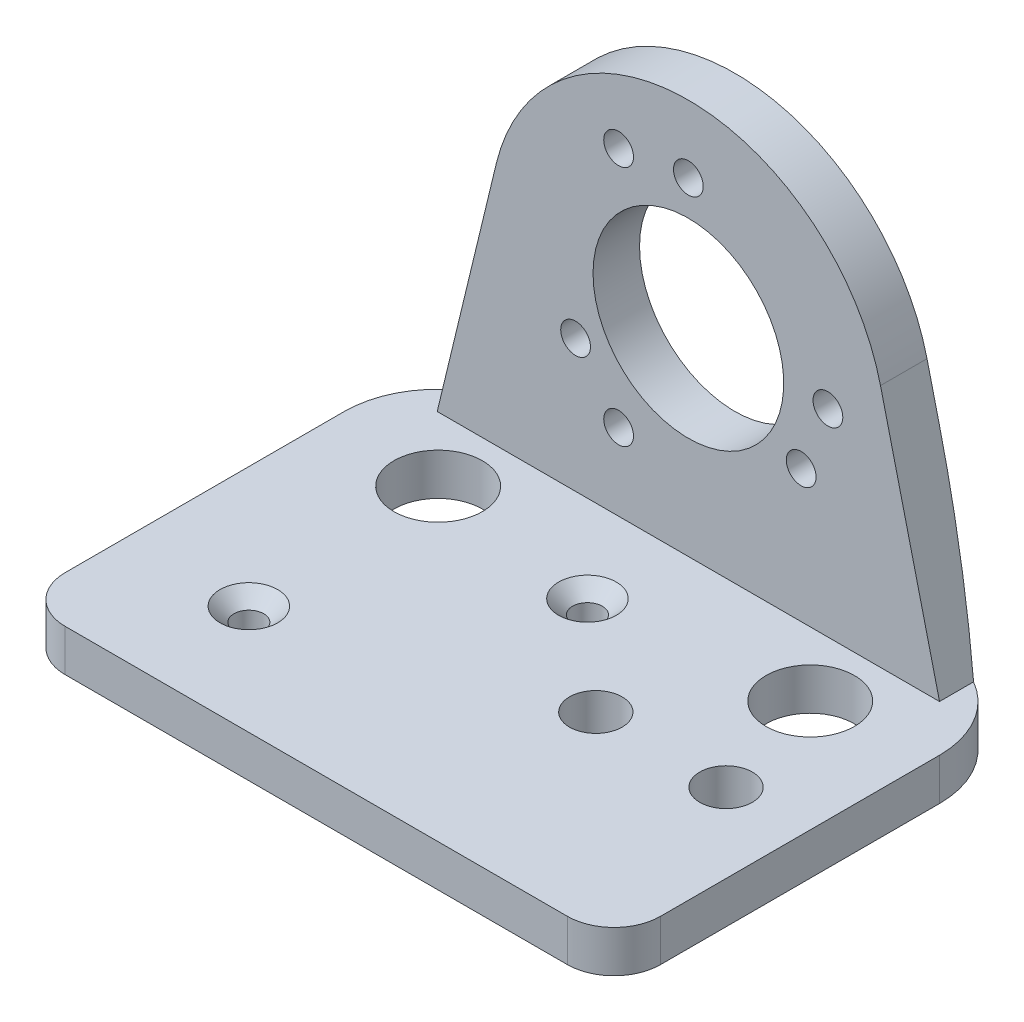
ISO-10303-21;
HEADER;
FILE_DESCRIPTION(('STEP AP214'),'2;1');
FILE_NAME('part.step','',(''),(''),'','','');
FILE_SCHEMA(('AUTOMOTIVE_DESIGN { 1 0 10303 214 1 1 1 1 }'));
ENDSEC;
DATA;
#1=APPLICATION_CONTEXT('core data for automotive mechanical design processes');
#2=APPLICATION_PROTOCOL_DEFINITION('international standard','automotive_design',2000,#1);
#3=PRODUCT_CONTEXT('',#1,'mechanical');
#4=PRODUCT('Part','Part','',(#3));
#5=PRODUCT_RELATED_PRODUCT_CATEGORY('part','',(#4));
#6=PRODUCT_DEFINITION_FORMATION('','',#4);
#7=PRODUCT_DEFINITION_CONTEXT('part definition',#1,'design');
#8=PRODUCT_DEFINITION('design','',#6,#7);
#9=PRODUCT_DEFINITION_SHAPE('','',#8);
#10=(LENGTH_UNIT() NAMED_UNIT(*) SI_UNIT(.MILLI.,.METRE.));
#11=(NAMED_UNIT(*) PLANE_ANGLE_UNIT() SI_UNIT($,.RADIAN.));
#12=(NAMED_UNIT(*) SI_UNIT($,.STERADIAN.) SOLID_ANGLE_UNIT());
#13=UNCERTAINTY_MEASURE_WITH_UNIT(LENGTH_MEASURE(1.E-05),#10,'distance_accuracy_value','');
#14=(GEOMETRIC_REPRESENTATION_CONTEXT(3) GLOBAL_UNCERTAINTY_ASSIGNED_CONTEXT((#13)) GLOBAL_UNIT_ASSIGNED_CONTEXT((#10,
#11,#12)) REPRESENTATION_CONTEXT('',''));
#15=CARTESIAN_POINT('',(0.,0.,0.));
#16=DIRECTION('',(0.,0.,1.));
#17=DIRECTION('',(1.,0.,0.));
#18=AXIS2_PLACEMENT_3D('',#15,#16,#17);
#19=CARTESIAN_POINT('',(-32.,-4.5,22.5));
#20=DIRECTION('',(-1.,0.,0.));
#21=DIRECTION('',(0.,0.,1.));
#22=AXIS2_PLACEMENT_3D('',#19,#20,#21);
#23=PLANE('',#22);
#24=DIRECTION('',(0.,0.,1.));
#25=VECTOR('',#24,1.);
#26=CARTESIAN_POINT('',(-32.,0.,22.5));
#27=LINE('',#26,#25);
#28=CARTESIAN_POINT('',(-32.,0.,-12.5));
#29=VERTEX_POINT('',#28);
#30=CARTESIAN_POINT('',(-32.,0.,17.5));
#31=VERTEX_POINT('',#30);
#32=EDGE_CURVE('E227',#29,#31,#27,.T.);
#33=ORIENTED_EDGE('',*,*,#32,.F.);
#34=DIRECTION('',(0.,1.,0.));
#35=VECTOR('',#34,1.);
#36=CARTESIAN_POINT('',(-32.,-4.5,-12.5));
#37=LINE('',#36,#35);
#38=CARTESIAN_POINT('',(-32.,-4.5,-12.5));
#39=VERTEX_POINT('',#38);
#40=EDGE_CURVE('E11',#29,#39,#37,.F.);
#41=ORIENTED_EDGE('',*,*,#40,.T.);
#42=DIRECTION('',(0.,0.,1.));
#43=VECTOR('',#42,1.);
#44=CARTESIAN_POINT('',(-32.,-4.5,22.5));
#45=LINE('',#44,#43);
#46=CARTESIAN_POINT('',(-32.,-4.5,17.5));
#47=VERTEX_POINT('',#46);
#48=EDGE_CURVE('E231',#39,#47,#45,.T.);
#49=ORIENTED_EDGE('',*,*,#48,.T.);
#50=DIRECTION('',(0.,1.,0.));
#51=VECTOR('',#50,1.);
#52=CARTESIAN_POINT('',(-32.,-4.5,17.5));
#53=LINE('',#52,#51);
#54=EDGE_CURVE('E297',#47,#31,#53,.T.);
#55=ORIENTED_EDGE('',*,*,#54,.T.);
#56=EDGE_LOOP('',(#33,#41,#49,#55));
#57=FACE_BOUND('',#56,.T.);
#58=ADVANCED_FACE('F47',(#57),#23,.T.);
#59=CARTESIAN_POINT('',(-32.,-4.5,-22.5));
#60=DIRECTION('',(0.,0.,-1.));
#61=DIRECTION('',(-1.,0.,0.));
#62=AXIS2_PLACEMENT_3D('',#59,#60,#61);
#63=PLANE('',#62);
#64=DIRECTION('',(0.235004499973529,-0.971994282386574,0.));
#65=VECTOR('',#64,1.);
#66=CARTESIAN_POINT('',(24.7695038509315,9.22548080578893,-22.5));
#67=LINE('',#66,#65);
#68=CARTESIAN_POINT('',(20.6548785007147,26.2438456244375,-22.5));
#69=VERTEX_POINT('',#68);
#70=CARTESIAN_POINT('',(22.,20.6803334084253,-22.5));
#71=VERTEX_POINT('',#70);
#72=EDGE_CURVE('E165',#69,#71,#67,.T.);
#73=ORIENTED_EDGE('',*,*,#72,.T.);
#74=DIRECTION('',(0.,1.,0.));
#75=VECTOR('',#74,1.);
#76=CARTESIAN_POINT('',(22.,-4.5,-22.5));
#77=LINE('',#76,#75);
#78=CARTESIAN_POINT('',(22.,-4.5,-22.5));
#79=VERTEX_POINT('',#78);
#80=EDGE_CURVE('E318',#71,#79,#77,.F.);
#81=ORIENTED_EDGE('',*,*,#80,.T.);
#82=DIRECTION('',(-1.,0.,0.));
#83=VECTOR('',#82,1.);
#84=CARTESIAN_POINT('',(-32.,-4.5,-22.5));
#85=LINE('',#84,#83);
#86=CARTESIAN_POINT('',(-22.,-4.5,-22.5));
#87=VERTEX_POINT('',#86);
#88=EDGE_CURVE('E243',#79,#87,#85,.T.);
#89=ORIENTED_EDGE('',*,*,#88,.T.);
#90=DIRECTION('',(0.,1.,0.));
#91=VECTOR('',#90,1.);
#92=CARTESIAN_POINT('',(-22.,-4.5,-22.5));
#93=LINE('',#92,#91);
#94=CARTESIAN_POINT('',(-22.,20.6803334084253,-22.5));
#95=VERTEX_POINT('',#94);
#96=EDGE_CURVE('E314',#87,#95,#93,.T.);
#97=ORIENTED_EDGE('',*,*,#96,.T.);
#98=DIRECTION('',(0.23500449997353,0.971994282386574,0.));
#99=VECTOR('',#98,1.);
#100=CARTESIAN_POINT('',(-28.3040392114313,-5.39359313401179,-22.5));
#101=LINE('',#100,#99);
#102=CARTESIAN_POINT('',(-20.6548785007147,26.2438456244375,-22.5));
#103=VERTEX_POINT('',#102);
#104=EDGE_CURVE('E176',#95,#103,#101,.T.);
#105=ORIENTED_EDGE('',*,*,#104,.T.);
#106=CARTESIAN_POINT('',(0.,21.25,-22.5));
#107=DIRECTION('',(0.,0.,-1.));
#108=DIRECTION('',(-1.,0.,0.));
#109=AXIS2_PLACEMENT_3D('',#106,#107,#108);
#110=CIRCLE('',#109,21.25);
#111=EDGE_CURVE('E143',#103,#69,#110,.T.);
#112=ORIENTED_EDGE('',*,*,#111,.T.);
#113=EDGE_LOOP('',(#73,#81,#89,#97,#105,#112));
#114=FACE_BOUND('',#113,.T.);
#115=CARTESIAN_POINT('',(0.,21.25,-22.5));
#116=DIRECTION('',(0.,0.,-1.));
#117=DIRECTION('',(-1.,0.,0.));
#118=AXIS2_PLACEMENT_3D('',#115,#116,#117);
#119=CIRCLE('',#118,10.25);
#120=CARTESIAN_POINT('',(-10.25,21.25,-22.5));
#121=VERTEX_POINT('',#120);
#122=EDGE_CURVE('E171',#121,#121,#119,.T.);
#123=ORIENTED_EDGE('',*,*,#122,.F.);
#124=EDGE_LOOP('',(#123));
#125=FACE_BOUND('',#124,.T.);
#126=CARTESIAN_POINT('',(0.,35.2500000000002,-22.5));
#127=DIRECTION('',(0.,0.,-1.));
#128=DIRECTION('',(-1.,0.,0.));
#129=AXIS2_PLACEMENT_3D('',#126,#127,#128);
#130=CIRCLE('',#129,1.59999999999994);
#131=CARTESIAN_POINT('',(-1.59999999999994,35.2500000000002,-22.5));
#132=VERTEX_POINT('',#131);
#133=EDGE_CURVE('E693',#132,#132,#130,.T.);
#134=ORIENTED_EDGE('',*,*,#133,.F.);
#135=EDGE_LOOP('',(#134));
#136=FACE_BOUND('',#135,.T.);
#137=CARTESIAN_POINT('',(-7.49999999999992,34.2403810567666,-22.5));
#138=DIRECTION('',(0.,0.,-1.));
#139=DIRECTION('',(-1.,0.,0.));
#140=AXIS2_PLACEMENT_3D('',#137,#138,#139);
#141=CIRCLE('',#140,1.6);
#142=CARTESIAN_POINT('',(-9.09999999999992,34.2403810567666,-22.5));
#143=VERTEX_POINT('',#142);
#144=EDGE_CURVE('E699',#143,#143,#141,.T.);
#145=ORIENTED_EDGE('',*,*,#144,.F.);
#146=EDGE_LOOP('',(#145));
#147=FACE_BOUND('',#146,.T.);
#148=CARTESIAN_POINT('',(12.1243556529821,14.25,-22.5));
#149=DIRECTION('',(0.,0.,-1.));
#150=DIRECTION('',(-1.,0.,0.));
#151=AXIS2_PLACEMENT_3D('',#148,#149,#150);
#152=CIRCLE('',#151,1.6);
#153=CARTESIAN_POINT('',(10.5243556529821,14.25,-22.5));
#154=VERTEX_POINT('',#153);
#155=EDGE_CURVE('E705',#154,#154,#152,.T.);
#156=ORIENTED_EDGE('',*,*,#155,.F.);
#157=EDGE_LOOP('',(#156));
#158=FACE_BOUND('',#157,.T.);
#159=CARTESIAN_POINT('',(15.,21.2500000000001,-22.5));
#160=DIRECTION('',(0.,0.,-1.));
#161=DIRECTION('',(-1.,0.,0.));
#162=AXIS2_PLACEMENT_3D('',#159,#160,#161);
#163=CIRCLE('',#162,1.59999999999994);
#164=CARTESIAN_POINT('',(13.4000000000001,21.2500000000001,-22.5));
#165=VERTEX_POINT('',#164);
#166=EDGE_CURVE('E711',#165,#165,#163,.T.);
#167=ORIENTED_EDGE('',*,*,#166,.F.);
#168=EDGE_LOOP('',(#167));
#169=FACE_BOUND('',#168,.T.);
#170=CARTESIAN_POINT('',(-12.1243556529821,14.2500000000001,-22.5));
#171=DIRECTION('',(0.,0.,-1.));
#172=DIRECTION('',(-1.,0.,0.));
#173=AXIS2_PLACEMENT_3D('',#170,#171,#172);
#174=CIRCLE('',#173,1.59999999999995);
#175=CARTESIAN_POINT('',(-13.7243556529821,14.2500000000001,-22.5));
#176=VERTEX_POINT('',#175);
#177=EDGE_CURVE('E717',#176,#176,#174,.T.);
#178=ORIENTED_EDGE('',*,*,#177,.F.);
#179=EDGE_LOOP('',(#178));
#180=FACE_BOUND('',#179,.T.);
#181=CARTESIAN_POINT('',(-7.50000000000006,8.25961894323362,-22.5));
#182=DIRECTION('',(0.,0.,-1.));
#183=DIRECTION('',(-1.,0.,0.));
#184=AXIS2_PLACEMENT_3D('',#181,#182,#183);
#185=CIRCLE('',#184,1.59999999999995);
#186=CARTESIAN_POINT('',(-9.10000000000001,8.25961894323362,-22.5));
#187=VERTEX_POINT('',#186);
#188=EDGE_CURVE('E723',#187,#187,#185,.T.);
#189=ORIENTED_EDGE('',*,*,#188,.F.);
#190=EDGE_LOOP('',(#189));
#191=FACE_BOUND('',#190,.T.);
#192=ADVANCED_FACE('F333',(#114,#125,#136,#147,#158,#169,#180,#191),#63,.T.);
#193=CARTESIAN_POINT('',(32.,-4.5,22.5));
#194=DIRECTION('',(1.,0.,0.));
#195=DIRECTION('',(0.,0.,-1.));
#196=AXIS2_PLACEMENT_3D('',#193,#194,#195);
#197=PLANE('',#196);
#198=DIRECTION('',(0.,0.,-1.));
#199=VECTOR('',#198,1.);
#200=CARTESIAN_POINT('',(32.,-4.5,22.5));
#201=LINE('',#200,#199);
#202=CARTESIAN_POINT('',(32.,-4.5,17.5));
#203=VERTEX_POINT('',#202);
#204=CARTESIAN_POINT('',(32.,-4.5,-12.5));
#205=VERTEX_POINT('',#204);
#206=EDGE_CURVE('E239',#203,#205,#201,.T.);
#207=ORIENTED_EDGE('',*,*,#206,.T.);
#208=DIRECTION('',(0.,1.,0.));
#209=VECTOR('',#208,1.);
#210=CARTESIAN_POINT('',(32.,-4.5,-12.5));
#211=LINE('',#210,#209);
#212=CARTESIAN_POINT('',(32.,0.,-12.5));
#213=VERTEX_POINT('',#212);
#214=EDGE_CURVE('E301',#205,#213,#211,.T.);
#215=ORIENTED_EDGE('',*,*,#214,.T.);
#216=DIRECTION('',(0.,0.,-1.));
#217=VECTOR('',#216,1.);
#218=CARTESIAN_POINT('',(32.,0.,22.5));
#219=LINE('',#218,#217);
#220=CARTESIAN_POINT('',(32.,0.,17.5));
#221=VERTEX_POINT('',#220);
#222=EDGE_CURVE('E235',#221,#213,#219,.T.);
#223=ORIENTED_EDGE('',*,*,#222,.F.);
#224=DIRECTION('',(0.,1.,0.));
#225=VECTOR('',#224,1.);
#226=CARTESIAN_POINT('',(32.,-4.5,17.5));
#227=LINE('',#226,#225);
#228=EDGE_CURVE('E287',#221,#203,#227,.F.);
#229=ORIENTED_EDGE('',*,*,#228,.T.);
#230=EDGE_LOOP('',(#207,#215,#223,#229));
#231=FACE_BOUND('',#230,.T.);
#232=ADVANCED_FACE('F346',(#231),#197,.T.);
#233=CARTESIAN_POINT('',(-32.,-4.5,22.5));
#234=DIRECTION('',(0.,0.,1.));
#235=DIRECTION('',(1.,0.,0.));
#236=AXIS2_PLACEMENT_3D('',#233,#234,#235);
#237=PLANE('',#236);
#238=DIRECTION('',(1.,0.,0.));
#239=VECTOR('',#238,1.);
#240=CARTESIAN_POINT('',(-32.,-4.5,22.5));
#241=LINE('',#240,#239);
#242=CARTESIAN_POINT('',(-27.,-4.5,22.5));
#243=VERTEX_POINT('',#242);
#244=CARTESIAN_POINT('',(27.,-4.5,22.5));
#245=VERTEX_POINT('',#244);
#246=EDGE_CURVE('E234',#243,#245,#241,.T.);
#247=ORIENTED_EDGE('',*,*,#246,.T.);
#248=DIRECTION('',(0.,1.,0.));
#249=VECTOR('',#248,1.);
#250=CARTESIAN_POINT('',(27.,-4.5,22.5));
#251=LINE('',#250,#249);
#252=CARTESIAN_POINT('',(27.,0.,22.5));
#253=VERTEX_POINT('',#252);
#254=EDGE_CURVE('E277',#245,#253,#251,.T.);
#255=ORIENTED_EDGE('',*,*,#254,.T.);
#256=DIRECTION('',(1.,0.,0.));
#257=VECTOR('',#256,1.);
#258=CARTESIAN_POINT('',(-32.,0.,22.5));
#259=LINE('',#258,#257);
#260=CARTESIAN_POINT('',(-27.,0.,22.5));
#261=VERTEX_POINT('',#260);
#262=EDGE_CURVE('E249',#261,#253,#259,.T.);
#263=ORIENTED_EDGE('',*,*,#262,.F.);
#264=DIRECTION('',(0.,1.,0.));
#265=VECTOR('',#264,1.);
#266=CARTESIAN_POINT('',(-27.,-4.5,22.5));
#267=LINE('',#266,#265);
#268=EDGE_CURVE('E274',#261,#243,#267,.F.);
#269=ORIENTED_EDGE('',*,*,#268,.T.);
#270=EDGE_LOOP('',(#247,#255,#263,#269));
#271=FACE_BOUND('',#270,.T.);
#272=ADVANCED_FACE('F354',(#271),#237,.T.);
#273=CARTESIAN_POINT('',(0.,-4.5,0.));
#274=DIRECTION('',(0.,-1.,0.));
#275=DIRECTION('',(0.,0.,-1.));
#276=AXIS2_PLACEMENT_3D('',#273,#274,#275);
#277=PLANE('',#276);
#278=ORIENTED_EDGE('',*,*,#88,.F.);
#279=CARTESIAN_POINT('',(22.,-4.5,-12.5));
#280=DIRECTION('',(0.,-1.,0.));
#281=DIRECTION('',(0.,0.,-1.));
#282=AXIS2_PLACEMENT_3D('',#279,#280,#281);
#283=CIRCLE('',#282,10.);
#284=EDGE_CURVE('E323',#79,#205,#283,.T.);
#285=ORIENTED_EDGE('',*,*,#284,.T.);
#286=ORIENTED_EDGE('',*,*,#206,.F.);
#287=CARTESIAN_POINT('',(27.,-4.5,17.5));
#288=DIRECTION('',(0.,-1.,0.));
#289=DIRECTION('',(0.,0.,-1.));
#290=AXIS2_PLACEMENT_3D('',#287,#288,#289);
#291=CIRCLE('',#290,5.);
#292=EDGE_CURVE('E294',#203,#245,#291,.T.);
#293=ORIENTED_EDGE('',*,*,#292,.T.);
#294=ORIENTED_EDGE('',*,*,#246,.F.);
#295=CARTESIAN_POINT('',(-27.,-4.5,17.5));
#296=DIRECTION('',(0.,-1.,0.));
#297=DIRECTION('',(0.,0.,-1.));
#298=AXIS2_PLACEMENT_3D('',#295,#296,#297);
#299=CIRCLE('',#298,5.);
#300=EDGE_CURVE('E290',#243,#47,#299,.T.);
#301=ORIENTED_EDGE('',*,*,#300,.T.);
#302=ORIENTED_EDGE('',*,*,#48,.F.);
#303=CARTESIAN_POINT('',(-22.,-4.5,-12.5));
#304=DIRECTION('',(0.,-1.,0.));
#305=DIRECTION('',(0.,0.,-1.));
#306=AXIS2_PLACEMENT_3D('',#303,#304,#305);
#307=CIRCLE('',#306,10.);
#308=EDGE_CURVE('E68',#39,#87,#307,.T.);
#309=ORIENTED_EDGE('',*,*,#308,.T.);
#310=EDGE_LOOP('',(#278,#285,#286,#293,#294,#301,#302,#309));
#311=FACE_BOUND('',#310,.T.);
#312=CARTESIAN_POINT('',(-20.,-4.5,-10.6));
#313=DIRECTION('',(0.,1.,0.));
#314=DIRECTION('',(0.,0.,1.));
#315=AXIS2_PLACEMENT_3D('',#312,#313,#314);
#316=CIRCLE('',#315,4.75);
#317=CARTESIAN_POINT('',(-20.,-4.5,-5.85));
#318=VERTEX_POINT('',#317);
#319=EDGE_CURVE('E191',#318,#318,#316,.T.);
#320=ORIENTED_EDGE('',*,*,#319,.T.);
#321=EDGE_LOOP('',(#320));
#322=FACE_BOUND('',#321,.T.);
#323=CARTESIAN_POINT('',(9.5,-4.5,1.95));
#324=DIRECTION('',(0.,1.,0.));
#325=DIRECTION('',(0.,0.,1.));
#326=AXIS2_PLACEMENT_3D('',#323,#324,#325);
#327=CIRCLE('',#326,2.825);
#328=CARTESIAN_POINT('',(9.5,-4.5,4.775));
#329=VERTEX_POINT('',#328);
#330=EDGE_CURVE('E199',#329,#329,#327,.T.);
#331=ORIENTED_EDGE('',*,*,#330,.T.);
#332=EDGE_LOOP('',(#331));
#333=FACE_BOUND('',#332,.T.);
#334=CARTESIAN_POINT('',(20.,-4.5,-10.6));
#335=DIRECTION('',(0.,1.,0.));
#336=DIRECTION('',(0.,0.,1.));
#337=AXIS2_PLACEMENT_3D('',#334,#335,#336);
#338=CIRCLE('',#337,4.75);
#339=CARTESIAN_POINT('',(20.,-4.5,-5.85));
#340=VERTEX_POINT('',#339);
#341=EDGE_CURVE('E207',#340,#340,#338,.T.);
#342=ORIENTED_EDGE('',*,*,#341,.T.);
#343=EDGE_LOOP('',(#342));
#344=FACE_BOUND('',#343,.T.);
#345=CARTESIAN_POINT('',(-19.,-4.5,10.75));
#346=DIRECTION('',(0.,1.,0.));
#347=DIRECTION('',(0.,0.,1.));
#348=AXIS2_PLACEMENT_3D('',#345,#346,#347);
#349=CIRCLE('',#348,1.6);
#350=CARTESIAN_POINT('',(-19.,-4.5,12.35));
#351=VERTEX_POINT('',#350);
#352=EDGE_CURVE('E211',#351,#351,#349,.T.);
#353=ORIENTED_EDGE('',*,*,#352,.T.);
#354=EDGE_LOOP('',(#353));
#355=FACE_BOUND('',#354,.T.);
#356=CARTESIAN_POINT('',(-1.5,-4.5,-8.15));
#357=DIRECTION('',(0.,1.,0.));
#358=DIRECTION('',(0.,0.,1.));
#359=AXIS2_PLACEMENT_3D('',#356,#357,#358);
#360=CIRCLE('',#359,1.6);
#361=CARTESIAN_POINT('',(-1.5,-4.5,-6.55));
#362=VERTEX_POINT('',#361);
#363=EDGE_CURVE('E218',#362,#362,#360,.T.);
#364=ORIENTED_EDGE('',*,*,#363,.T.);
#365=EDGE_LOOP('',(#364));
#366=FACE_BOUND('',#365,.T.);
#367=CARTESIAN_POINT('',(23.5,-4.5,1.95));
#368=DIRECTION('',(0.,1.,0.));
#369=DIRECTION('',(0.,0.,1.));
#370=AXIS2_PLACEMENT_3D('',#367,#368,#369);
#371=CIRCLE('',#370,2.825);
#372=CARTESIAN_POINT('',(23.5,-4.5,4.775));
#373=VERTEX_POINT('',#372);
#374=EDGE_CURVE('E223',#373,#373,#371,.T.);
#375=ORIENTED_EDGE('',*,*,#374,.T.);
#376=EDGE_LOOP('',(#375));
#377=FACE_BOUND('',#376,.T.);
#378=ADVANCED_FACE('F337',(#311,#322,#333,#344,#355,#366,#377),#277,.T.);
#379=CARTESIAN_POINT('',(0.,0.,0.));
#380=DIRECTION('',(0.,-1.,0.));
#381=DIRECTION('',(0.,0.,-1.));
#382=AXIS2_PLACEMENT_3D('',#379,#380,#381);
#383=PLANE('',#382);
#384=ORIENTED_EDGE('',*,*,#222,.T.);
#385=CARTESIAN_POINT('',(22.,0.,-12.5));
#386=DIRECTION('',(0.,-1.,0.));
#387=DIRECTION('',(0.,0.,-1.));
#388=AXIS2_PLACEMENT_3D('',#385,#386,#387);
#389=CIRCLE('',#388,10.);
#390=CARTESIAN_POINT('',(27.,0.,-21.1602540378444));
#391=VERTEX_POINT('',#390);
#392=EDGE_CURVE('E308',#213,#391,#389,.F.);
#393=ORIENTED_EDGE('',*,*,#392,.T.);
#394=DIRECTION('',(0.,0.,-1.));
#395=VECTOR('',#394,1.);
#396=CARTESIAN_POINT('',(27.,0.,-17.5));
#397=LINE('',#396,#395);
#398=CARTESIAN_POINT('',(27.,0.,-17.5));
#399=VERTEX_POINT('',#398);
#400=EDGE_CURVE('E182',#399,#391,#397,.T.);
#401=ORIENTED_EDGE('',*,*,#400,.F.);
#402=DIRECTION('',(1.,0.,0.));
#403=VECTOR('',#402,1.);
#404=CARTESIAN_POINT('',(0.,0.,-17.5));
#405=LINE('',#404,#403);
#406=CARTESIAN_POINT('',(-27.,0.,-17.5));
#407=VERTEX_POINT('',#406);
#408=EDGE_CURVE('E271',#407,#399,#405,.T.);
#409=ORIENTED_EDGE('',*,*,#408,.F.);
#410=DIRECTION('',(0.,0.,-1.));
#411=VECTOR('',#410,1.);
#412=CARTESIAN_POINT('',(-27.,0.,-17.5));
#413=LINE('',#412,#411);
#414=CARTESIAN_POINT('',(-27.,0.,-21.1602540378444));
#415=VERTEX_POINT('',#414);
#416=EDGE_CURVE('E149',#407,#415,#413,.T.);
#417=ORIENTED_EDGE('',*,*,#416,.T.);
#418=CARTESIAN_POINT('',(-22.,0.,-12.5));
#419=DIRECTION('',(0.,-1.,0.));
#420=DIRECTION('',(0.,0.,-1.));
#421=AXIS2_PLACEMENT_3D('',#418,#419,#420);
#422=CIRCLE('',#421,10.);
#423=EDGE_CURVE('E305',#415,#29,#422,.F.);
#424=ORIENTED_EDGE('',*,*,#423,.T.);
#425=ORIENTED_EDGE('',*,*,#32,.T.);
#426=CARTESIAN_POINT('',(-27.,0.,17.5));
#427=DIRECTION('',(0.,-1.,0.));
#428=DIRECTION('',(0.,0.,-1.));
#429=AXIS2_PLACEMENT_3D('',#426,#427,#428);
#430=CIRCLE('',#429,5.);
#431=EDGE_CURVE('E281',#31,#261,#430,.F.);
#432=ORIENTED_EDGE('',*,*,#431,.T.);
#433=ORIENTED_EDGE('',*,*,#262,.T.);
#434=CARTESIAN_POINT('',(27.,0.,17.5));
#435=DIRECTION('',(0.,-1.,0.));
#436=DIRECTION('',(0.,0.,-1.));
#437=AXIS2_PLACEMENT_3D('',#434,#435,#436);
#438=CIRCLE('',#437,5.);
#439=EDGE_CURVE('E284',#253,#221,#438,.F.);
#440=ORIENTED_EDGE('',*,*,#439,.T.);
#441=EDGE_LOOP('',(#384,#393,#401,#409,#417,#424,#425,#432,#433,#440));
#442=FACE_BOUND('',#441,.T.);
#443=CARTESIAN_POINT('',(-19.,0.,10.75));
#444=DIRECTION('',(0.,-1.,0.));
#445=DIRECTION('',(0.,0.,-1.));
#446=AXIS2_PLACEMENT_3D('',#443,#444,#445);
#447=CIRCLE('',#446,3.10000000000001);
#448=CARTESIAN_POINT('',(-19.,0.,7.65));
#449=VERTEX_POINT('',#448);
#450=EDGE_CURVE('E263',#449,#449,#447,.T.);
#451=ORIENTED_EDGE('',*,*,#450,.T.);
#452=EDGE_LOOP('',(#451));
#453=FACE_BOUND('',#452,.T.);
#454=CARTESIAN_POINT('',(-1.5,0.,-8.15));
#455=DIRECTION('',(0.,-1.,0.));
#456=DIRECTION('',(0.,0.,-1.));
#457=AXIS2_PLACEMENT_3D('',#454,#455,#456);
#458=CIRCLE('',#457,3.10000000000001);
#459=CARTESIAN_POINT('',(-1.5,0.,-11.25));
#460=VERTEX_POINT('',#459);
#461=EDGE_CURVE('E259',#460,#460,#458,.T.);
#462=ORIENTED_EDGE('',*,*,#461,.T.);
#463=EDGE_LOOP('',(#462));
#464=FACE_BOUND('',#463,.T.);
#465=CARTESIAN_POINT('',(-20.,0.,-10.6));
#466=DIRECTION('',(0.,1.,0.));
#467=DIRECTION('',(0.,0.,1.));
#468=AXIS2_PLACEMENT_3D('',#465,#466,#467);
#469=CIRCLE('',#468,4.75);
#470=CARTESIAN_POINT('',(-20.,0.,-5.85));
#471=VERTEX_POINT('',#470);
#472=EDGE_CURVE('E186',#471,#471,#469,.T.);
#473=ORIENTED_EDGE('',*,*,#472,.F.);
#474=EDGE_LOOP('',(#473));
#475=FACE_BOUND('',#474,.T.);
#476=CARTESIAN_POINT('',(9.5,0.,1.95));
#477=DIRECTION('',(0.,1.,0.));
#478=DIRECTION('',(0.,0.,1.));
#479=AXIS2_PLACEMENT_3D('',#476,#477,#478);
#480=CIRCLE('',#479,2.825);
#481=CARTESIAN_POINT('',(9.5,0.,4.775));
#482=VERTEX_POINT('',#481);
#483=EDGE_CURVE('E195',#482,#482,#480,.T.);
#484=ORIENTED_EDGE('',*,*,#483,.F.);
#485=EDGE_LOOP('',(#484));
#486=FACE_BOUND('',#485,.T.);
#487=CARTESIAN_POINT('',(20.,0.,-10.6));
#488=DIRECTION('',(0.,1.,0.));
#489=DIRECTION('',(0.,0.,1.));
#490=AXIS2_PLACEMENT_3D('',#487,#488,#489);
#491=CIRCLE('',#490,4.75);
#492=CARTESIAN_POINT('',(20.,0.,-5.85));
#493=VERTEX_POINT('',#492);
#494=EDGE_CURVE('E203',#493,#493,#491,.T.);
#495=ORIENTED_EDGE('',*,*,#494,.F.);
#496=EDGE_LOOP('',(#495));
#497=FACE_BOUND('',#496,.T.);
#498=CARTESIAN_POINT('',(23.5,0.,1.95));
#499=DIRECTION('',(0.,1.,0.));
#500=DIRECTION('',(0.,0.,1.));
#501=AXIS2_PLACEMENT_3D('',#498,#499,#500);
#502=CIRCLE('',#501,2.825);
#503=CARTESIAN_POINT('',(23.5,0.,4.775));
#504=VERTEX_POINT('',#503);
#505=EDGE_CURVE('E222',#504,#504,#502,.T.);
#506=ORIENTED_EDGE('',*,*,#505,.F.);
#507=EDGE_LOOP('',(#506));
#508=FACE_BOUND('',#507,.T.);
#509=ADVANCED_FACE('F330',(#442,#453,#464,#475,#486,#497,#508),#383,.F.);
#510=CARTESIAN_POINT('',(23.5,-4.5,1.95));
#511=DIRECTION('',(0.,1.,0.));
#512=DIRECTION('',(0.,0.,1.));
#513=AXIS2_PLACEMENT_3D('',#510,#511,#512);
#514=CYLINDRICAL_SURFACE('',#513,2.825);
#515=ORIENTED_EDGE('',*,*,#374,.F.);
#516=EDGE_LOOP('',(#515));
#517=FACE_BOUND('',#516,.T.);
#518=ORIENTED_EDGE('',*,*,#505,.T.);
#519=EDGE_LOOP('',(#518));
#520=FACE_BOUND('',#519,.T.);
#521=ADVANCED_FACE('F591',(#517,#520),#514,.F.);
#522=CARTESIAN_POINT('',(-1.5,-4.5,-8.15));
#523=DIRECTION('',(0.,1.,0.));
#524=DIRECTION('',(0.,0.,1.));
#525=AXIS2_PLACEMENT_3D('',#522,#523,#524);
#526=CYLINDRICAL_SURFACE('',#525,1.6);
#527=CARTESIAN_POINT('',(-1.5,-1.5,-8.15));
#528=DIRECTION('',(0.,-1.,0.));
#529=DIRECTION('',(0.,0.,-1.));
#530=AXIS2_PLACEMENT_3D('',#527,#528,#529);
#531=CIRCLE('',#530,1.6);
#532=CARTESIAN_POINT('',(-1.5,-1.5,-9.75));
#533=VERTEX_POINT('',#532);
#534=EDGE_CURVE('E267',#533,#533,#531,.F.);
#535=ORIENTED_EDGE('',*,*,#534,.T.);
#536=EDGE_LOOP('',(#535));
#537=FACE_BOUND('',#536,.T.);
#538=ORIENTED_EDGE('',*,*,#363,.F.);
#539=EDGE_LOOP('',(#538));
#540=FACE_BOUND('',#539,.T.);
#541=ADVANCED_FACE('F582',(#537,#540),#526,.F.);
#542=CARTESIAN_POINT('',(-19.,-4.5,10.75));
#543=DIRECTION('',(0.,1.,0.));
#544=DIRECTION('',(0.,0.,1.));
#545=AXIS2_PLACEMENT_3D('',#542,#543,#544);
#546=CYLINDRICAL_SURFACE('',#545,1.6);
#547=CARTESIAN_POINT('',(-19.,-1.5,10.75));
#548=DIRECTION('',(0.,-1.,0.));
#549=DIRECTION('',(0.,0.,-1.));
#550=AXIS2_PLACEMENT_3D('',#547,#548,#549);
#551=CIRCLE('',#550,1.6);
#552=CARTESIAN_POINT('',(-19.,-1.5,9.15));
#553=VERTEX_POINT('',#552);
#554=EDGE_CURVE('E246',#553,#553,#551,.F.);
#555=ORIENTED_EDGE('',*,*,#554,.T.);
#556=EDGE_LOOP('',(#555));
#557=FACE_BOUND('',#556,.T.);
#558=ORIENTED_EDGE('',*,*,#352,.F.);
#559=EDGE_LOOP('',(#558));
#560=FACE_BOUND('',#559,.T.);
#561=ADVANCED_FACE('F572',(#557,#560),#546,.F.);
#562=CARTESIAN_POINT('',(20.,-4.5,-10.6));
#563=DIRECTION('',(0.,1.,0.));
#564=DIRECTION('',(0.,0.,1.));
#565=AXIS2_PLACEMENT_3D('',#562,#563,#564);
#566=CYLINDRICAL_SURFACE('',#565,4.75);
#567=ORIENTED_EDGE('',*,*,#341,.F.);
#568=EDGE_LOOP('',(#567));
#569=FACE_BOUND('',#568,.T.);
#570=ORIENTED_EDGE('',*,*,#494,.T.);
#571=EDGE_LOOP('',(#570));
#572=FACE_BOUND('',#571,.T.);
#573=ADVANCED_FACE('F562',(#569,#572),#566,.F.);
#574=CARTESIAN_POINT('',(9.5,-4.5,1.95));
#575=DIRECTION('',(0.,1.,0.));
#576=DIRECTION('',(0.,0.,1.));
#577=AXIS2_PLACEMENT_3D('',#574,#575,#576);
#578=CYLINDRICAL_SURFACE('',#577,2.825);
#579=ORIENTED_EDGE('',*,*,#330,.F.);
#580=EDGE_LOOP('',(#579));
#581=FACE_BOUND('',#580,.T.);
#582=ORIENTED_EDGE('',*,*,#483,.T.);
#583=EDGE_LOOP('',(#582));
#584=FACE_BOUND('',#583,.T.);
#585=ADVANCED_FACE('F551',(#581,#584),#578,.F.);
#586=CARTESIAN_POINT('',(-20.,-4.5,-10.6));
#587=DIRECTION('',(0.,1.,0.));
#588=DIRECTION('',(0.,0.,1.));
#589=AXIS2_PLACEMENT_3D('',#586,#587,#588);
#590=CYLINDRICAL_SURFACE('',#589,4.75);
#591=ORIENTED_EDGE('',*,*,#319,.F.);
#592=EDGE_LOOP('',(#591));
#593=FACE_BOUND('',#592,.T.);
#594=ORIENTED_EDGE('',*,*,#472,.T.);
#595=EDGE_LOOP('',(#594));
#596=FACE_BOUND('',#595,.T.);
#597=ADVANCED_FACE('F380',(#593,#596),#590,.F.);
#598=CARTESIAN_POINT('',(-19.,-1.5,10.75));
#599=DIRECTION('',(0.,1.,0.));
#600=DIRECTION('',(0.,0.,1.));
#601=AXIS2_PLACEMENT_3D('',#598,#599,#600);
#602=CONICAL_SURFACE('',#601,1.6,0.785398163397449);
#603=ORIENTED_EDGE('',*,*,#450,.F.);
#604=EDGE_LOOP('',(#603));
#605=FACE_BOUND('',#604,.T.);
#606=ORIENTED_EDGE('',*,*,#554,.F.);
#607=EDGE_LOOP('',(#606));
#608=FACE_BOUND('',#607,.T.);
#609=ADVANCED_FACE('F373',(#605,#608),#602,.F.);
#610=CARTESIAN_POINT('',(-1.5,-1.5,-8.15));
#611=DIRECTION('',(0.,1.,0.));
#612=DIRECTION('',(0.,0.,1.));
#613=AXIS2_PLACEMENT_3D('',#610,#611,#612);
#614=CONICAL_SURFACE('',#613,1.6,0.785398163397449);
#615=ORIENTED_EDGE('',*,*,#461,.F.);
#616=EDGE_LOOP('',(#615));
#617=FACE_BOUND('',#616,.T.);
#618=ORIENTED_EDGE('',*,*,#534,.F.);
#619=EDGE_LOOP('',(#618));
#620=FACE_BOUND('',#619,.T.);
#621=ADVANCED_FACE('F379',(#617,#620),#614,.F.);
#622=CARTESIAN_POINT('',(0.,21.25,-17.5));
#623=DIRECTION('',(0.,0.,-1.));
#624=DIRECTION('',(-1.,0.,0.));
#625=AXIS2_PLACEMENT_3D('',#622,#623,#624);
#626=PLANE('',#625);
#627=CARTESIAN_POINT('',(-7.50000000000006,8.25961894323362,-17.5));
#628=DIRECTION('',(0.,0.,-1.));
#629=DIRECTION('',(-1.,0.,0.));
#630=AXIS2_PLACEMENT_3D('',#627,#628,#629);
#631=CIRCLE('',#630,1.59999999999995);
#632=CARTESIAN_POINT('',(-9.10000000000001,8.25961894323362,-17.5));
#633=VERTEX_POINT('',#632);
#634=EDGE_CURVE('E666',#633,#633,#631,.T.);
#635=ORIENTED_EDGE('',*,*,#634,.T.);
#636=EDGE_LOOP('',(#635));
#637=FACE_BOUND('',#636,.T.);
#638=CARTESIAN_POINT('',(-12.1243556529821,14.2500000000001,-17.5));
#639=DIRECTION('',(0.,0.,-1.));
#640=DIRECTION('',(-1.,0.,0.));
#641=AXIS2_PLACEMENT_3D('',#638,#639,#640);
#642=CIRCLE('',#641,1.59999999999995);
#643=CARTESIAN_POINT('',(-13.7243556529821,14.2500000000001,-17.5));
#644=VERTEX_POINT('',#643);
#645=EDGE_CURVE('E670',#644,#644,#642,.T.);
#646=ORIENTED_EDGE('',*,*,#645,.T.);
#647=EDGE_LOOP('',(#646));
#648=FACE_BOUND('',#647,.T.);
#649=CARTESIAN_POINT('',(15.,21.2500000000001,-17.5));
#650=DIRECTION('',(0.,0.,-1.));
#651=DIRECTION('',(-1.,0.,0.));
#652=AXIS2_PLACEMENT_3D('',#649,#650,#651);
#653=CIRCLE('',#652,1.59999999999994);
#654=CARTESIAN_POINT('',(13.4000000000001,21.2500000000001,-17.5));
#655=VERTEX_POINT('',#654);
#656=EDGE_CURVE('E674',#655,#655,#653,.T.);
#657=ORIENTED_EDGE('',*,*,#656,.T.);
#658=EDGE_LOOP('',(#657));
#659=FACE_BOUND('',#658,.T.);
#660=CARTESIAN_POINT('',(12.1243556529821,14.25,-17.5));
#661=DIRECTION('',(0.,0.,-1.));
#662=DIRECTION('',(-1.,0.,0.));
#663=AXIS2_PLACEMENT_3D('',#660,#661,#662);
#664=CIRCLE('',#663,1.6);
#665=CARTESIAN_POINT('',(10.5243556529821,14.25,-17.5));
#666=VERTEX_POINT('',#665);
#667=EDGE_CURVE('E678',#666,#666,#664,.T.);
#668=ORIENTED_EDGE('',*,*,#667,.T.);
#669=EDGE_LOOP('',(#668));
#670=FACE_BOUND('',#669,.T.);
#671=CARTESIAN_POINT('',(-7.49999999999992,34.2403810567666,-17.5));
#672=DIRECTION('',(0.,0.,-1.));
#673=DIRECTION('',(-1.,0.,0.));
#674=AXIS2_PLACEMENT_3D('',#671,#672,#673);
#675=CIRCLE('',#674,1.6);
#676=CARTESIAN_POINT('',(-9.09999999999992,34.2403810567666,-17.5));
#677=VERTEX_POINT('',#676);
#678=EDGE_CURVE('E682',#677,#677,#675,.T.);
#679=ORIENTED_EDGE('',*,*,#678,.T.);
#680=EDGE_LOOP('',(#679));
#681=FACE_BOUND('',#680,.T.);
#682=CARTESIAN_POINT('',(0.,35.2500000000002,-17.5));
#683=DIRECTION('',(0.,0.,-1.));
#684=DIRECTION('',(-1.,0.,0.));
#685=AXIS2_PLACEMENT_3D('',#682,#683,#684);
#686=CIRCLE('',#685,1.59999999999994);
#687=CARTESIAN_POINT('',(-1.59999999999994,35.2500000000002,-17.5));
#688=VERTEX_POINT('',#687);
#689=EDGE_CURVE('E686',#688,#688,#686,.T.);
#690=ORIENTED_EDGE('',*,*,#689,.T.);
#691=EDGE_LOOP('',(#690));
#692=FACE_BOUND('',#691,.T.);
#693=CARTESIAN_POINT('',(0.,21.25,-17.5));
#694=DIRECTION('',(0.,0.,-1.));
#695=DIRECTION('',(-1.,0.,0.));
#696=AXIS2_PLACEMENT_3D('',#693,#694,#695);
#697=CIRCLE('',#696,10.25);
#698=CARTESIAN_POINT('',(-10.25,21.25,-17.5));
#699=VERTEX_POINT('',#698);
#700=EDGE_CURVE('E179',#699,#699,#697,.T.);
#701=ORIENTED_EDGE('',*,*,#700,.T.);
#702=EDGE_LOOP('',(#701));
#703=FACE_BOUND('',#702,.T.);
#704=DIRECTION('',(0.23500449997353,0.971994282386574,0.));
#705=VECTOR('',#704,1.);
#706=CARTESIAN_POINT('',(-28.3040392114313,-5.39359313401179,-17.5));
#707=LINE('',#706,#705);
#708=CARTESIAN_POINT('',(-20.6548785007147,26.2438456244375,-17.5));
#709=VERTEX_POINT('',#708);
#710=EDGE_CURVE('E156',#407,#709,#707,.T.);
#711=ORIENTED_EDGE('',*,*,#710,.F.);
#712=ORIENTED_EDGE('',*,*,#408,.T.);
#713=DIRECTION('',(0.235004499973529,-0.971994282386574,0.));
#714=VECTOR('',#713,1.);
#715=CARTESIAN_POINT('',(24.7695038509315,9.22548080578893,-17.5));
#716=LINE('',#715,#714);
#717=CARTESIAN_POINT('',(20.6548785007147,26.2438456244375,-17.5));
#718=VERTEX_POINT('',#717);
#719=EDGE_CURVE('E158',#718,#399,#716,.T.);
#720=ORIENTED_EDGE('',*,*,#719,.F.);
#721=CARTESIAN_POINT('',(0.,21.25,-17.5));
#722=DIRECTION('',(0.,0.,-1.));
#723=DIRECTION('',(-1.,0.,0.));
#724=AXIS2_PLACEMENT_3D('',#721,#722,#723);
#725=CIRCLE('',#724,21.25);
#726=EDGE_CURVE('E141',#709,#718,#725,.T.);
#727=ORIENTED_EDGE('',*,*,#726,.F.);
#728=EDGE_LOOP('',(#711,#712,#720,#727));
#729=FACE_BOUND('',#728,.T.);
#730=ADVANCED_FACE('F154',(#637,#648,#659,#670,#681,#692,#703,#729),#626,.F.);
#731=CARTESIAN_POINT('',(24.7695038509315,9.22548080578893,-17.5));
#732=DIRECTION('',(0.971994282386574,0.235004499973529,0.));
#733=DIRECTION('',(-0.235004499973529,0.971994282386574,0.));
#734=AXIS2_PLACEMENT_3D('',#731,#732,#733);
#735=PLANE('',#734);
#736=ORIENTED_EDGE('',*,*,#400,.T.);
#737=CARTESIAN_POINT('',(22.,20.6803334084253,-12.5));
#738=DIRECTION('',(0.971994282386574,0.235004499973529,0.));
#739=DIRECTION('',(-0.235004499973529,0.971994282386574,0.));
#740=AXIS2_PLACEMENT_3D('',#737,#738,#739);
#741=ELLIPSE('',#740,42.5523766614103,10.);
#742=EDGE_CURVE('E311',#391,#71,#741,.T.);
#743=ORIENTED_EDGE('',*,*,#742,.T.);
#744=ORIENTED_EDGE('',*,*,#72,.F.);
#745=DIRECTION('',(0.,0.,-1.));
#746=VECTOR('',#745,1.);
#747=CARTESIAN_POINT('',(20.6548785007147,26.2438456244375,-17.5));
#748=LINE('',#747,#746);
#749=EDGE_CURVE('E148',#718,#69,#748,.T.);
#750=ORIENTED_EDGE('',*,*,#749,.F.);
#751=ORIENTED_EDGE('',*,*,#719,.T.);
#752=EDGE_LOOP('',(#736,#743,#744,#750,#751));
#753=FACE_BOUND('',#752,.T.);
#754=ADVANCED_FACE('F501',(#753),#735,.T.);
#755=CARTESIAN_POINT('',(0.,21.25,-17.5));
#756=DIRECTION('',(0.,0.,-1.));
#757=DIRECTION('',(-1.,0.,0.));
#758=AXIS2_PLACEMENT_3D('',#755,#756,#757);
#759=CYLINDRICAL_SURFACE('',#758,21.25);
#760=ORIENTED_EDGE('',*,*,#111,.F.);
#761=DIRECTION('',(0.,0.,-1.));
#762=VECTOR('',#761,1.);
#763=CARTESIAN_POINT('',(-20.6548785007147,26.2438456244375,-17.5));
#764=LINE('',#763,#762);
#765=EDGE_CURVE('E138',#709,#103,#764,.T.);
#766=ORIENTED_EDGE('',*,*,#765,.F.);
#767=ORIENTED_EDGE('',*,*,#726,.T.);
#768=ORIENTED_EDGE('',*,*,#749,.T.);
#769=EDGE_LOOP('',(#760,#766,#767,#768));
#770=FACE_BOUND('',#769,.T.);
#771=ADVANCED_FACE('F140',(#770),#759,.T.);
#772=CARTESIAN_POINT('',(-28.3040392114313,-5.39359313401179,-17.5));
#773=DIRECTION('',(-0.971994282386574,0.23500449997353,0.));
#774=DIRECTION('',(-0.23500449997353,-0.971994282386574,0.));
#775=AXIS2_PLACEMENT_3D('',#772,#773,#774);
#776=PLANE('',#775);
#777=ORIENTED_EDGE('',*,*,#104,.F.);
#778=CARTESIAN_POINT('',(-22.,20.6803334084253,-12.5));
#779=DIRECTION('',(-0.971994282386574,0.23500449997353,0.));
#780=DIRECTION('',(0.23500449997353,0.971994282386574,0.));
#781=AXIS2_PLACEMENT_3D('',#778,#779,#780);
#782=ELLIPSE('',#781,42.5523766614102,10.);
#783=EDGE_CURVE('E56',#95,#415,#782,.T.);
#784=ORIENTED_EDGE('',*,*,#783,.T.);
#785=ORIENTED_EDGE('',*,*,#416,.F.);
#786=ORIENTED_EDGE('',*,*,#710,.T.);
#787=ORIENTED_EDGE('',*,*,#765,.T.);
#788=EDGE_LOOP('',(#777,#784,#785,#786,#787));
#789=FACE_BOUND('',#788,.T.);
#790=ADVANCED_FACE('F162',(#789),#776,.T.);
#791=CARTESIAN_POINT('',(0.,21.25,-17.5));
#792=DIRECTION('',(0.,0.,-1.));
#793=DIRECTION('',(-1.,0.,0.));
#794=AXIS2_PLACEMENT_3D('',#791,#792,#793);
#795=CYLINDRICAL_SURFACE('',#794,10.25);
#796=ORIENTED_EDGE('',*,*,#700,.F.);
#797=EDGE_LOOP('',(#796));
#798=FACE_BOUND('',#797,.T.);
#799=ORIENTED_EDGE('',*,*,#122,.T.);
#800=EDGE_LOOP('',(#799));
#801=FACE_BOUND('',#800,.T.);
#802=ADVANCED_FACE('F474',(#798,#801),#795,.F.);
#803=CARTESIAN_POINT('',(0.,35.2500000000002,-17.5));
#804=DIRECTION('',(0.,0.,-1.));
#805=DIRECTION('',(-1.,0.,0.));
#806=AXIS2_PLACEMENT_3D('',#803,#804,#805);
#807=CYLINDRICAL_SURFACE('',#806,1.59999999999994);
#808=ORIENTED_EDGE('',*,*,#689,.F.);
#809=EDGE_LOOP('',(#808));
#810=FACE_BOUND('',#809,.T.);
#811=ORIENTED_EDGE('',*,*,#133,.T.);
#812=EDGE_LOOP('',(#811));
#813=FACE_BOUND('',#812,.T.);
#814=ADVANCED_FACE('F464',(#810,#813),#807,.F.);
#815=CARTESIAN_POINT('',(-7.49999999999992,34.2403810567666,-17.5));
#816=DIRECTION('',(0.,0.,-1.));
#817=DIRECTION('',(-1.,0.,0.));
#818=AXIS2_PLACEMENT_3D('',#815,#816,#817);
#819=CYLINDRICAL_SURFACE('',#818,1.6);
#820=ORIENTED_EDGE('',*,*,#678,.F.);
#821=EDGE_LOOP('',(#820));
#822=FACE_BOUND('',#821,.T.);
#823=ORIENTED_EDGE('',*,*,#144,.T.);
#824=EDGE_LOOP('',(#823));
#825=FACE_BOUND('',#824,.T.);
#826=ADVANCED_FACE('F454',(#822,#825),#819,.F.);
#827=CARTESIAN_POINT('',(12.1243556529821,14.25,-17.5));
#828=DIRECTION('',(0.,0.,-1.));
#829=DIRECTION('',(-1.,0.,0.));
#830=AXIS2_PLACEMENT_3D('',#827,#828,#829);
#831=CYLINDRICAL_SURFACE('',#830,1.6);
#832=ORIENTED_EDGE('',*,*,#667,.F.);
#833=EDGE_LOOP('',(#832));
#834=FACE_BOUND('',#833,.T.);
#835=ORIENTED_EDGE('',*,*,#155,.T.);
#836=EDGE_LOOP('',(#835));
#837=FACE_BOUND('',#836,.T.);
#838=ADVANCED_FACE('F444',(#834,#837),#831,.F.);
#839=CARTESIAN_POINT('',(15.,21.2500000000001,-17.5));
#840=DIRECTION('',(0.,0.,-1.));
#841=DIRECTION('',(-1.,0.,0.));
#842=AXIS2_PLACEMENT_3D('',#839,#840,#841);
#843=CYLINDRICAL_SURFACE('',#842,1.59999999999994);
#844=ORIENTED_EDGE('',*,*,#656,.F.);
#845=EDGE_LOOP('',(#844));
#846=FACE_BOUND('',#845,.T.);
#847=ORIENTED_EDGE('',*,*,#166,.T.);
#848=EDGE_LOOP('',(#847));
#849=FACE_BOUND('',#848,.T.);
#850=ADVANCED_FACE('F434',(#846,#849),#843,.F.);
#851=CARTESIAN_POINT('',(-12.1243556529821,14.2500000000001,-17.5));
#852=DIRECTION('',(0.,0.,-1.));
#853=DIRECTION('',(-1.,0.,0.));
#854=AXIS2_PLACEMENT_3D('',#851,#852,#853);
#855=CYLINDRICAL_SURFACE('',#854,1.59999999999995);
#856=ORIENTED_EDGE('',*,*,#645,.F.);
#857=EDGE_LOOP('',(#856));
#858=FACE_BOUND('',#857,.T.);
#859=ORIENTED_EDGE('',*,*,#177,.T.);
#860=EDGE_LOOP('',(#859));
#861=FACE_BOUND('',#860,.T.);
#862=ADVANCED_FACE('F424',(#858,#861),#855,.F.);
#863=CARTESIAN_POINT('',(-7.50000000000006,8.25961894323362,-17.5));
#864=DIRECTION('',(0.,0.,-1.));
#865=DIRECTION('',(-1.,0.,0.));
#866=AXIS2_PLACEMENT_3D('',#863,#864,#865);
#867=CYLINDRICAL_SURFACE('',#866,1.59999999999995);
#868=ORIENTED_EDGE('',*,*,#634,.F.);
#869=EDGE_LOOP('',(#868));
#870=FACE_BOUND('',#869,.T.);
#871=ORIENTED_EDGE('',*,*,#188,.T.);
#872=EDGE_LOOP('',(#871));
#873=FACE_BOUND('',#872,.T.);
#874=ADVANCED_FACE('F389',(#870,#873),#867,.F.);
#875=CARTESIAN_POINT('',(27.,-4.5,17.5));
#876=DIRECTION('',(0.,1.,0.));
#877=DIRECTION('',(0.,0.,1.));
#878=AXIS2_PLACEMENT_3D('',#875,#876,#877);
#879=CYLINDRICAL_SURFACE('',#878,5.);
#880=ORIENTED_EDGE('',*,*,#292,.F.);
#881=ORIENTED_EDGE('',*,*,#228,.F.);
#882=ORIENTED_EDGE('',*,*,#439,.F.);
#883=ORIENTED_EDGE('',*,*,#254,.F.);
#884=EDGE_LOOP('',(#880,#881,#882,#883));
#885=FACE_BOUND('',#884,.T.);
#886=ADVANCED_FACE('F352',(#885),#879,.T.);
#887=CARTESIAN_POINT('',(-27.,-4.5,17.5));
#888=DIRECTION('',(0.,1.,0.));
#889=DIRECTION('',(0.,0.,1.));
#890=AXIS2_PLACEMENT_3D('',#887,#888,#889);
#891=CYLINDRICAL_SURFACE('',#890,5.);
#892=ORIENTED_EDGE('',*,*,#300,.F.);
#893=ORIENTED_EDGE('',*,*,#268,.F.);
#894=ORIENTED_EDGE('',*,*,#431,.F.);
#895=ORIENTED_EDGE('',*,*,#54,.F.);
#896=EDGE_LOOP('',(#892,#893,#894,#895));
#897=FACE_BOUND('',#896,.T.);
#898=ADVANCED_FACE('F360',(#897),#891,.T.);
#899=CARTESIAN_POINT('',(22.,-4.5,-12.5));
#900=DIRECTION('',(0.,1.,0.));
#901=DIRECTION('',(0.,0.,1.));
#902=AXIS2_PLACEMENT_3D('',#899,#900,#901);
#903=CYLINDRICAL_SURFACE('',#902,10.);
#904=ORIENTED_EDGE('',*,*,#284,.F.);
#905=ORIENTED_EDGE('',*,*,#80,.F.);
#906=ORIENTED_EDGE('',*,*,#742,.F.);
#907=ORIENTED_EDGE('',*,*,#392,.F.);
#908=ORIENTED_EDGE('',*,*,#214,.F.);
#909=EDGE_LOOP('',(#904,#905,#906,#907,#908));
#910=FACE_BOUND('',#909,.T.);
#911=ADVANCED_FACE('F342',(#910),#903,.T.);
#912=CARTESIAN_POINT('',(-22.,-4.5,-12.5));
#913=DIRECTION('',(0.,1.,0.));
#914=DIRECTION('',(0.,0.,1.));
#915=AXIS2_PLACEMENT_3D('',#912,#913,#914);
#916=CYLINDRICAL_SURFACE('',#915,10.);
#917=ORIENTED_EDGE('',*,*,#308,.F.);
#918=ORIENTED_EDGE('',*,*,#40,.F.);
#919=ORIENTED_EDGE('',*,*,#423,.F.);
#920=ORIENTED_EDGE('',*,*,#783,.F.);
#921=ORIENTED_EDGE('',*,*,#96,.F.);
#922=EDGE_LOOP('',(#917,#918,#919,#920,#921));
#923=FACE_BOUND('',#922,.T.);
#924=ADVANCED_FACE('F49',(#923),#916,.T.);
#925=CLOSED_SHELL('',(#58,#192,#232,#272,#378,#509,#521,#541,#561,#573,#585,#597,#609,#621,#730,
#754,#771,#790,#802,#814,#826,#838,#850,#862,#874,#886,#898,#911,#924));
#926=MANIFOLD_SOLID_BREP('B2',#925);
#927=ADVANCED_BREP_SHAPE_REPRESENTATION('',(#18,#926),#14);
#928=SHAPE_DEFINITION_REPRESENTATION(#9,#927);
ENDSEC;
END-ISO-10303-21;
